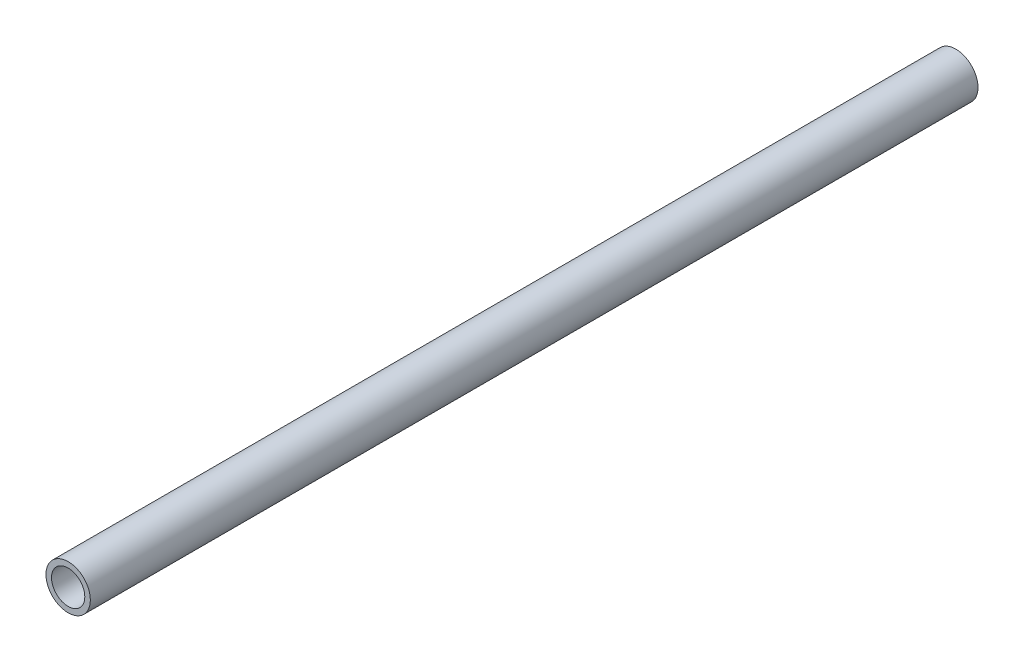
ISO-10303-21;
HEADER;
FILE_DESCRIPTION(('STEP AP214'),'2;1');
FILE_NAME('part.step','',(''),(''),'','','');
FILE_SCHEMA(('AUTOMOTIVE_DESIGN { 1 0 10303 214 1 1 1 1 }'));
ENDSEC;
DATA;
#1=APPLICATION_CONTEXT('core data for automotive mechanical design processes');
#2=APPLICATION_PROTOCOL_DEFINITION('international standard','automotive_design',2000,#1);
#3=PRODUCT_CONTEXT('',#1,'mechanical');
#4=PRODUCT('Part','Part','',(#3));
#5=PRODUCT_RELATED_PRODUCT_CATEGORY('part','',(#4));
#6=PRODUCT_DEFINITION_FORMATION('','',#4);
#7=PRODUCT_DEFINITION_CONTEXT('part definition',#1,'design');
#8=PRODUCT_DEFINITION('design','',#6,#7);
#9=PRODUCT_DEFINITION_SHAPE('','',#8);
#10=(LENGTH_UNIT() NAMED_UNIT(*) SI_UNIT(.MILLI.,.METRE.));
#11=(NAMED_UNIT(*) PLANE_ANGLE_UNIT() SI_UNIT($,.RADIAN.));
#12=(NAMED_UNIT(*) SI_UNIT($,.STERADIAN.) SOLID_ANGLE_UNIT());
#13=UNCERTAINTY_MEASURE_WITH_UNIT(LENGTH_MEASURE(1.E-05),#10,'distance_accuracy_value','');
#14=(GEOMETRIC_REPRESENTATION_CONTEXT(3) GLOBAL_UNCERTAINTY_ASSIGNED_CONTEXT((#13)) GLOBAL_UNIT_ASSIGNED_CONTEXT((#10,
#11,#12)) REPRESENTATION_CONTEXT('',''));
#15=CARTESIAN_POINT('',(0.,0.,0.));
#16=DIRECTION('',(0.,0.,1.));
#17=DIRECTION('',(1.,0.,0.));
#18=AXIS2_PLACEMENT_3D('',#15,#16,#17);
#19=CARTESIAN_POINT('',(0.,0.,160.));
#20=DIRECTION('',(0.,0.,1.));
#21=DIRECTION('',(1.,0.,0.));
#22=AXIS2_PLACEMENT_3D('',#19,#20,#21);
#23=PLANE('',#22);
#24=CARTESIAN_POINT('',(0.,0.,160.));
#25=DIRECTION('',(0.,0.,1.));
#26=DIRECTION('',(1.,0.,0.));
#27=AXIS2_PLACEMENT_3D('',#24,#25,#26);
#28=CIRCLE('',#27,4.);
#29=CARTESIAN_POINT('',(4.,0.,160.));
#30=VERTEX_POINT('',#29);
#31=EDGE_CURVE('E10',#30,#30,#28,.T.);
#32=ORIENTED_EDGE('',*,*,#31,.T.);
#33=EDGE_LOOP('',(#32));
#34=FACE_BOUND('',#33,.T.);
#35=CARTESIAN_POINT('',(0.,0.,160.));
#36=DIRECTION('',(0.,0.,1.));
#37=DIRECTION('',(1.,0.,0.));
#38=AXIS2_PLACEMENT_3D('',#35,#36,#37);
#39=CIRCLE('',#38,3.);
#40=CARTESIAN_POINT('',(3.,0.,160.));
#41=VERTEX_POINT('',#40);
#42=EDGE_CURVE('E54',#41,#41,#39,.T.);
#43=ORIENTED_EDGE('',*,*,#42,.F.);
#44=EDGE_LOOP('',(#43));
#45=FACE_BOUND('',#44,.T.);
#46=ADVANCED_FACE('F41',(#34,#45),#23,.T.);
#47=CARTESIAN_POINT('',(0.,0.,0.));
#48=DIRECTION('',(0.,0.,1.));
#49=DIRECTION('',(1.,0.,0.));
#50=AXIS2_PLACEMENT_3D('',#47,#48,#49);
#51=PLANE('',#50);
#52=CARTESIAN_POINT('',(0.,0.,0.));
#53=DIRECTION('',(0.,0.,1.));
#54=DIRECTION('',(1.,0.,0.));
#55=AXIS2_PLACEMENT_3D('',#52,#53,#54);
#56=CIRCLE('',#55,4.);
#57=CARTESIAN_POINT('',(4.,0.,0.));
#58=VERTEX_POINT('',#57);
#59=EDGE_CURVE('E45',#58,#58,#56,.T.);
#60=ORIENTED_EDGE('',*,*,#59,.F.);
#61=EDGE_LOOP('',(#60));
#62=FACE_BOUND('',#61,.T.);
#63=CARTESIAN_POINT('',(0.,0.,0.));
#64=DIRECTION('',(0.,0.,1.));
#65=DIRECTION('',(1.,0.,0.));
#66=AXIS2_PLACEMENT_3D('',#63,#64,#65);
#67=CIRCLE('',#66,3.);
#68=CARTESIAN_POINT('',(3.,0.,0.));
#69=VERTEX_POINT('',#68);
#70=EDGE_CURVE('E56',#69,#69,#67,.T.);
#71=ORIENTED_EDGE('',*,*,#70,.T.);
#72=EDGE_LOOP('',(#71));
#73=FACE_BOUND('',#72,.T.);
#74=ADVANCED_FACE('F68',(#62,#73),#51,.F.);
#75=CARTESIAN_POINT('',(0.,0.,160.));
#76=DIRECTION('',(0.,0.,-1.));
#77=DIRECTION('',(-1.,0.,0.));
#78=AXIS2_PLACEMENT_3D('',#75,#76,#77);
#79=CYLINDRICAL_SURFACE('',#78,4.);
#80=ORIENTED_EDGE('',*,*,#31,.F.);
#81=EDGE_LOOP('',(#80));
#82=FACE_BOUND('',#81,.T.);
#83=ORIENTED_EDGE('',*,*,#59,.T.);
#84=EDGE_LOOP('',(#83));
#85=FACE_BOUND('',#84,.T.);
#86=ADVANCED_FACE('F43',(#82,#85),#79,.T.);
#87=CARTESIAN_POINT('',(0.,0.,160.));
#88=DIRECTION('',(0.,0.,-1.));
#89=DIRECTION('',(-1.,0.,0.));
#90=AXIS2_PLACEMENT_3D('',#87,#88,#89);
#91=CYLINDRICAL_SURFACE('',#90,3.);
#92=ORIENTED_EDGE('',*,*,#42,.T.);
#93=EDGE_LOOP('',(#92));
#94=FACE_BOUND('',#93,.T.);
#95=ORIENTED_EDGE('',*,*,#70,.F.);
#96=EDGE_LOOP('',(#95));
#97=FACE_BOUND('',#96,.T.);
#98=ADVANCED_FACE('F64',(#94,#97),#91,.F.);
#99=CLOSED_SHELL('',(#46,#74,#86,#98));
#100=MANIFOLD_SOLID_BREP('B2',#99);
#101=ADVANCED_BREP_SHAPE_REPRESENTATION('',(#18,#100),#14);
#102=SHAPE_DEFINITION_REPRESENTATION(#9,#101);
ENDSEC;
END-ISO-10303-21;
